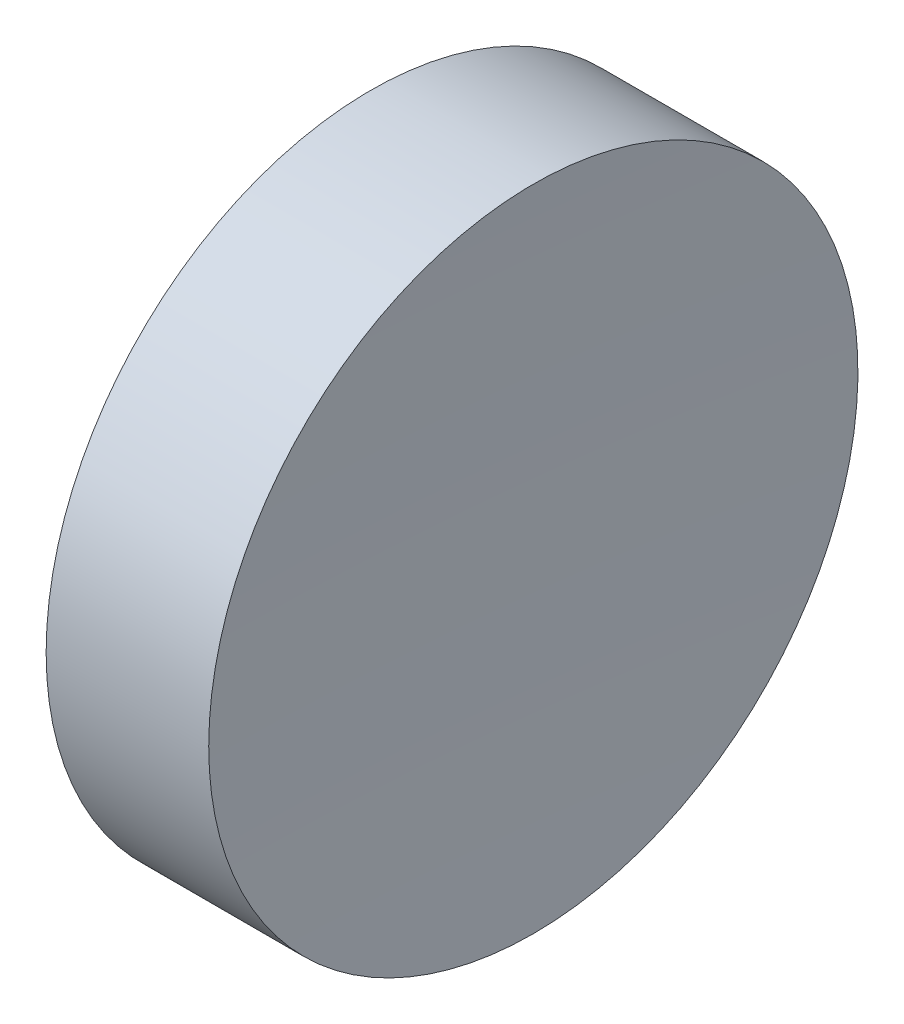
ISO-10303-21;
HEADER;
FILE_DESCRIPTION(('STEP AP214'),'2;1');
FILE_NAME('part.step','',(''),(''),'','','');
FILE_SCHEMA(('AUTOMOTIVE_DESIGN { 1 0 10303 214 1 1 1 1 }'));
ENDSEC;
DATA;
#1=APPLICATION_CONTEXT('core data for automotive mechanical design processes');
#2=APPLICATION_PROTOCOL_DEFINITION('international standard','automotive_design',2000,#1);
#3=PRODUCT_CONTEXT('',#1,'mechanical');
#4=PRODUCT('Part','Part','',(#3));
#5=PRODUCT_RELATED_PRODUCT_CATEGORY('part','',(#4));
#6=PRODUCT_DEFINITION_FORMATION('','',#4);
#7=PRODUCT_DEFINITION_CONTEXT('part definition',#1,'design');
#8=PRODUCT_DEFINITION('design','',#6,#7);
#9=PRODUCT_DEFINITION_SHAPE('','',#8);
#10=(LENGTH_UNIT() NAMED_UNIT(*) SI_UNIT(.MILLI.,.METRE.));
#11=(NAMED_UNIT(*) PLANE_ANGLE_UNIT() SI_UNIT($,.RADIAN.));
#12=(NAMED_UNIT(*) SI_UNIT($,.STERADIAN.) SOLID_ANGLE_UNIT());
#13=UNCERTAINTY_MEASURE_WITH_UNIT(LENGTH_MEASURE(1.E-05),#10,'distance_accuracy_value','');
#14=(GEOMETRIC_REPRESENTATION_CONTEXT(3) GLOBAL_UNCERTAINTY_ASSIGNED_CONTEXT((#13)) GLOBAL_UNIT_ASSIGNED_CONTEXT((#10,
#11,#12)) REPRESENTATION_CONTEXT('',''));
#15=CARTESIAN_POINT('',(0.,0.,0.));
#16=DIRECTION('',(0.,0.,1.));
#17=DIRECTION('',(1.,0.,0.));
#18=AXIS2_PLACEMENT_3D('',#15,#16,#17);
#19=CARTESIAN_POINT('',(421.092655515887,69.3780211233725,0.));
#20=DIRECTION('',(-1.,0.,0.));
#21=DIRECTION('',(0.,-1.,0.));
#22=AXIS2_PLACEMENT_3D('',#19,#20,#21);
#23=SPHERICAL_SURFACE('',#22,300.);
#24=CARTESIAN_POINT('',(121.353185308842,69.3780211233724,0.));
#25=DIRECTION('',(-1.,0.,0.));
#26=DIRECTION('',(0.,0.,1.));
#27=AXIS2_PLACEMENT_3D('',#24,#25,#26);
#28=CIRCLE('',#27,12.5);
#29=CARTESIAN_POINT('',(121.353185308842,69.3780211233724,12.5));
#30=VERTEX_POINT('',#29);
#31=EDGE_CURVE('E10',#30,#30,#28,.T.);
#32=ORIENTED_EDGE('',*,*,#31,.F.);
#33=EDGE_LOOP('',(#32));
#34=FACE_BOUND('',#33,.T.);
#35=ADVANCED_FACE('F35',(#34),#23,.F.);
#36=CARTESIAN_POINT('',(108.985143002165,69.3780211233724,0.));
#37=DIRECTION('',(-1.,0.,0.));
#38=DIRECTION('',(0.,0.,1.));
#39=AXIS2_PLACEMENT_3D('',#36,#37,#38);
#40=CYLINDRICAL_SURFACE('',#39,12.5);
#41=CARTESIAN_POINT('',(115.09265553492,69.3780211233724,0.));
#42=DIRECTION('',(-1.,0.,0.));
#43=DIRECTION('',(0.,0.,1.));
#44=AXIS2_PLACEMENT_3D('',#41,#42,#43);
#45=CIRCLE('',#44,12.5);
#46=CARTESIAN_POINT('',(115.09265553492,69.3780211233724,12.5));
#47=VERTEX_POINT('',#46);
#48=EDGE_CURVE('E41',#47,#47,#45,.T.);
#49=ORIENTED_EDGE('',*,*,#48,.F.);
#50=EDGE_LOOP('',(#49));
#51=FACE_BOUND('',#50,.T.);
#52=ORIENTED_EDGE('',*,*,#31,.T.);
#53=EDGE_LOOP('',(#52));
#54=FACE_BOUND('',#53,.T.);
#55=ADVANCED_FACE('F49',(#51,#54),#40,.T.);
#56=CARTESIAN_POINT('',(115.09265553492,69.3780211233724,0.));
#57=DIRECTION('',(1.,0.,0.));
#58=DIRECTION('',(0.,0.,-1.));
#59=AXIS2_PLACEMENT_3D('',#56,#57,#58);
#60=PLANE('',#59);
#61=ORIENTED_EDGE('',*,*,#48,.T.);
#62=EDGE_LOOP('',(#61));
#63=FACE_BOUND('',#62,.T.);
#64=ADVANCED_FACE('F47',(#63),#60,.F.);
#65=CLOSED_SHELL('',(#35,#55,#64));
#66=MANIFOLD_SOLID_BREP('B2',#65);
#67=ADVANCED_BREP_SHAPE_REPRESENTATION('',(#18,#66),#14);
#68=SHAPE_DEFINITION_REPRESENTATION(#9,#67);
ENDSEC;
END-ISO-10303-21;
